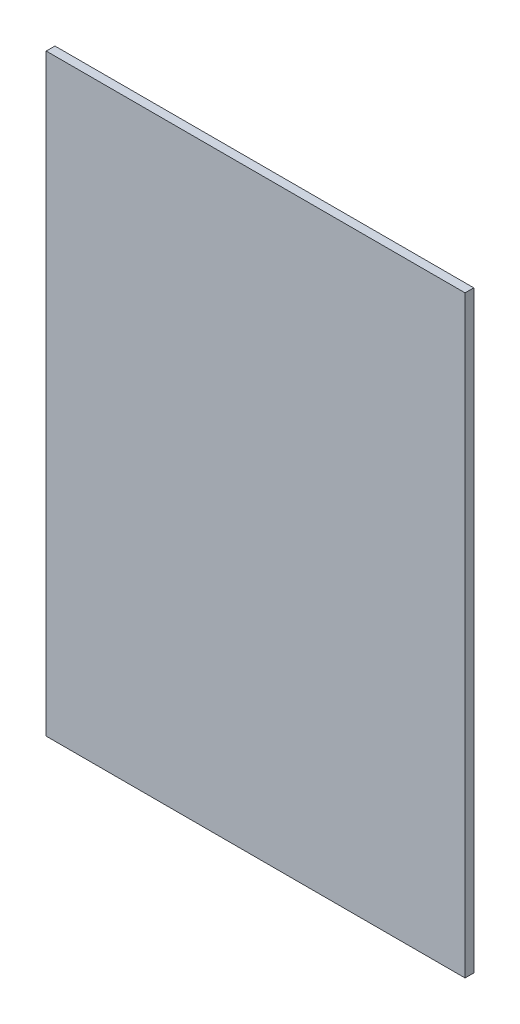
ISO-10303-21;
HEADER;
FILE_DESCRIPTION(('STEP AP214'),'2;1');
FILE_NAME('part.step','',(''),(''),'','','');
FILE_SCHEMA(('AUTOMOTIVE_DESIGN { 1 0 10303 214 1 1 1 1 }'));
ENDSEC;
DATA;
#1=APPLICATION_CONTEXT('core data for automotive mechanical design processes');
#2=APPLICATION_PROTOCOL_DEFINITION('international standard','automotive_design',2000,#1);
#3=PRODUCT_CONTEXT('',#1,'mechanical');
#4=PRODUCT('Part','Part','',(#3));
#5=PRODUCT_RELATED_PRODUCT_CATEGORY('part','',(#4));
#6=PRODUCT_DEFINITION_FORMATION('','',#4);
#7=PRODUCT_DEFINITION_CONTEXT('part definition',#1,'design');
#8=PRODUCT_DEFINITION('design','',#6,#7);
#9=PRODUCT_DEFINITION_SHAPE('','',#8);
#10=(LENGTH_UNIT() NAMED_UNIT(*) SI_UNIT(.MILLI.,.METRE.));
#11=(NAMED_UNIT(*) PLANE_ANGLE_UNIT() SI_UNIT($,.RADIAN.));
#12=(NAMED_UNIT(*) SI_UNIT($,.STERADIAN.) SOLID_ANGLE_UNIT());
#13=UNCERTAINTY_MEASURE_WITH_UNIT(LENGTH_MEASURE(1.E-05),#10,'distance_accuracy_value','');
#14=(GEOMETRIC_REPRESENTATION_CONTEXT(3) GLOBAL_UNCERTAINTY_ASSIGNED_CONTEXT((#13)) GLOBAL_UNIT_ASSIGNED_CONTEXT((#10,
#11,#12)) REPRESENTATION_CONTEXT('',''));
#15=CARTESIAN_POINT('',(0.,0.,0.));
#16=DIRECTION('',(0.,0.,1.));
#17=DIRECTION('',(1.,0.,0.));
#18=AXIS2_PLACEMENT_3D('',#15,#16,#17);
#19=CARTESIAN_POINT('',(-290.,340.,10.));
#20=DIRECTION('',(1.,0.,0.));
#21=DIRECTION('',(0.,1.,0.));
#22=AXIS2_PLACEMENT_3D('',#19,#20,#21);
#23=PLANE('',#22);
#24=DIRECTION('',(0.,-1.,0.));
#25=VECTOR('',#24,1.);
#26=CARTESIAN_POINT('',(-290.,340.,0.));
#27=LINE('',#26,#25);
#28=CARTESIAN_POINT('',(-290.,340.,0.));
#29=VERTEX_POINT('',#28);
#30=CARTESIAN_POINT('',(-290.,-340.,0.));
#31=VERTEX_POINT('',#30);
#32=EDGE_CURVE('E95',#29,#31,#27,.T.);
#33=ORIENTED_EDGE('',*,*,#32,.T.);
#34=DIRECTION('',(0.,0.,-1.));
#35=VECTOR('',#34,1.);
#36=CARTESIAN_POINT('',(-290.,-340.,10.));
#37=LINE('',#36,#35);
#38=CARTESIAN_POINT('',(-290.,-340.,10.));
#39=VERTEX_POINT('',#38);
#40=EDGE_CURVE('E11',#39,#31,#37,.T.);
#41=ORIENTED_EDGE('',*,*,#40,.F.);
#42=DIRECTION('',(0.,-1.,0.));
#43=VECTOR('',#42,1.);
#44=CARTESIAN_POINT('',(-290.,340.,10.));
#45=LINE('',#44,#43);
#46=CARTESIAN_POINT('',(-290.,340.,10.));
#47=VERTEX_POINT('',#46);
#48=EDGE_CURVE('E83',#47,#39,#45,.T.);
#49=ORIENTED_EDGE('',*,*,#48,.F.);
#50=DIRECTION('',(0.,0.,-1.));
#51=VECTOR('',#50,1.);
#52=CARTESIAN_POINT('',(-290.,340.,10.));
#53=LINE('',#52,#51);
#54=EDGE_CURVE('E91',#47,#29,#53,.T.);
#55=ORIENTED_EDGE('',*,*,#54,.T.);
#56=EDGE_LOOP('',(#33,#41,#49,#55));
#57=FACE_BOUND('',#56,.T.);
#58=ADVANCED_FACE('F32',(#57),#23,.F.);
#59=CARTESIAN_POINT('',(-290.,-340.,10.));
#60=DIRECTION('',(0.,1.,0.));
#61=DIRECTION('',(0.,0.,1.));
#62=AXIS2_PLACEMENT_3D('',#59,#60,#61);
#63=PLANE('',#62);
#64=DIRECTION('',(1.,0.,0.));
#65=VECTOR('',#64,1.);
#66=CARTESIAN_POINT('',(-290.,-340.,0.));
#67=LINE('',#66,#65);
#68=CARTESIAN_POINT('',(190.,-340.,0.));
#69=VERTEX_POINT('',#68);
#70=EDGE_CURVE('E87',#31,#69,#67,.T.);
#71=ORIENTED_EDGE('',*,*,#70,.T.);
#72=DIRECTION('',(0.,0.,-1.));
#73=VECTOR('',#72,1.);
#74=CARTESIAN_POINT('',(190.,-340.,10.));
#75=LINE('',#74,#73);
#76=CARTESIAN_POINT('',(190.,-340.,10.));
#77=VERTEX_POINT('',#76);
#78=EDGE_CURVE('E40',#77,#69,#75,.T.);
#79=ORIENTED_EDGE('',*,*,#78,.F.);
#80=DIRECTION('',(1.,0.,0.));
#81=VECTOR('',#80,1.);
#82=CARTESIAN_POINT('',(-290.,-340.,10.));
#83=LINE('',#82,#81);
#84=EDGE_CURVE('E78',#39,#77,#83,.T.);
#85=ORIENTED_EDGE('',*,*,#84,.F.);
#86=ORIENTED_EDGE('',*,*,#40,.T.);
#87=EDGE_LOOP('',(#71,#79,#85,#86));
#88=FACE_BOUND('',#87,.T.);
#89=ADVANCED_FACE('F86',(#88),#63,.F.);
#90=CARTESIAN_POINT('',(190.,340.,10.));
#91=DIRECTION('',(-1.,0.,0.));
#92=DIRECTION('',(0.,-1.,0.));
#93=AXIS2_PLACEMENT_3D('',#90,#91,#92);
#94=PLANE('',#93);
#95=DIRECTION('',(0.,1.,0.));
#96=VECTOR('',#95,1.);
#97=CARTESIAN_POINT('',(190.,340.,0.));
#98=LINE('',#97,#96);
#99=CARTESIAN_POINT('',(190.,340.,0.));
#100=VERTEX_POINT('',#99);
#101=EDGE_CURVE('E65',#69,#100,#98,.T.);
#102=ORIENTED_EDGE('',*,*,#101,.T.);
#103=DIRECTION('',(0.,0.,-1.));
#104=VECTOR('',#103,1.);
#105=CARTESIAN_POINT('',(190.,340.,10.));
#106=LINE('',#105,#104);
#107=CARTESIAN_POINT('',(190.,340.,10.));
#108=VERTEX_POINT('',#107);
#109=EDGE_CURVE('E88',#108,#100,#106,.T.);
#110=ORIENTED_EDGE('',*,*,#109,.F.);
#111=DIRECTION('',(0.,1.,0.));
#112=VECTOR('',#111,1.);
#113=CARTESIAN_POINT('',(190.,340.,10.));
#114=LINE('',#113,#112);
#115=EDGE_CURVE('E81',#77,#108,#114,.T.);
#116=ORIENTED_EDGE('',*,*,#115,.F.);
#117=ORIENTED_EDGE('',*,*,#78,.T.);
#118=EDGE_LOOP('',(#102,#110,#116,#117));
#119=FACE_BOUND('',#118,.T.);
#120=ADVANCED_FACE('F89',(#119),#94,.F.);
#121=CARTESIAN_POINT('',(-290.,340.,10.));
#122=DIRECTION('',(0.,-1.,0.));
#123=DIRECTION('',(0.,0.,-1.));
#124=AXIS2_PLACEMENT_3D('',#121,#122,#123);
#125=PLANE('',#124);
#126=DIRECTION('',(-1.,0.,0.));
#127=VECTOR('',#126,1.);
#128=CARTESIAN_POINT('',(-290.,340.,0.));
#129=LINE('',#128,#127);
#130=EDGE_CURVE('E71',#100,#29,#129,.T.);
#131=ORIENTED_EDGE('',*,*,#130,.T.);
#132=ORIENTED_EDGE('',*,*,#54,.F.);
#133=DIRECTION('',(-1.,0.,0.));
#134=VECTOR('',#133,1.);
#135=CARTESIAN_POINT('',(-290.,340.,10.));
#136=LINE('',#135,#134);
#137=EDGE_CURVE('E48',#108,#47,#136,.T.);
#138=ORIENTED_EDGE('',*,*,#137,.F.);
#139=ORIENTED_EDGE('',*,*,#109,.T.);
#140=EDGE_LOOP('',(#131,#132,#138,#139));
#141=FACE_BOUND('',#140,.T.);
#142=ADVANCED_FACE('F102',(#141),#125,.F.);
#143=CARTESIAN_POINT('',(0.,0.,10.));
#144=DIRECTION('',(0.,0.,1.));
#145=DIRECTION('',(1.,0.,0.));
#146=AXIS2_PLACEMENT_3D('',#143,#144,#145);
#147=PLANE('',#146);
#148=ORIENTED_EDGE('',*,*,#48,.T.);
#149=ORIENTED_EDGE('',*,*,#84,.T.);
#150=ORIENTED_EDGE('',*,*,#115,.T.);
#151=ORIENTED_EDGE('',*,*,#137,.T.);
#152=EDGE_LOOP('',(#148,#149,#150,#151));
#153=FACE_BOUND('',#152,.T.);
#154=ADVANCED_FACE('F79',(#153),#147,.T.);
#155=CARTESIAN_POINT('',(0.,0.,0.));
#156=DIRECTION('',(0.,0.,1.));
#157=DIRECTION('',(1.,0.,0.));
#158=AXIS2_PLACEMENT_3D('',#155,#156,#157);
#159=PLANE('',#158);
#160=ORIENTED_EDGE('',*,*,#32,.F.);
#161=ORIENTED_EDGE('',*,*,#130,.F.);
#162=ORIENTED_EDGE('',*,*,#101,.F.);
#163=ORIENTED_EDGE('',*,*,#70,.F.);
#164=EDGE_LOOP('',(#160,#161,#162,#163));
#165=FACE_BOUND('',#164,.T.);
#166=ADVANCED_FACE('F105',(#165),#159,.F.);
#167=CLOSED_SHELL('',(#58,#89,#120,#142,#154,#166));
#168=MANIFOLD_SOLID_BREP('B2',#167);
#169=ADVANCED_BREP_SHAPE_REPRESENTATION('',(#18,#168),#14);
#170=SHAPE_DEFINITION_REPRESENTATION(#9,#169);
ENDSEC;
END-ISO-10303-21;
